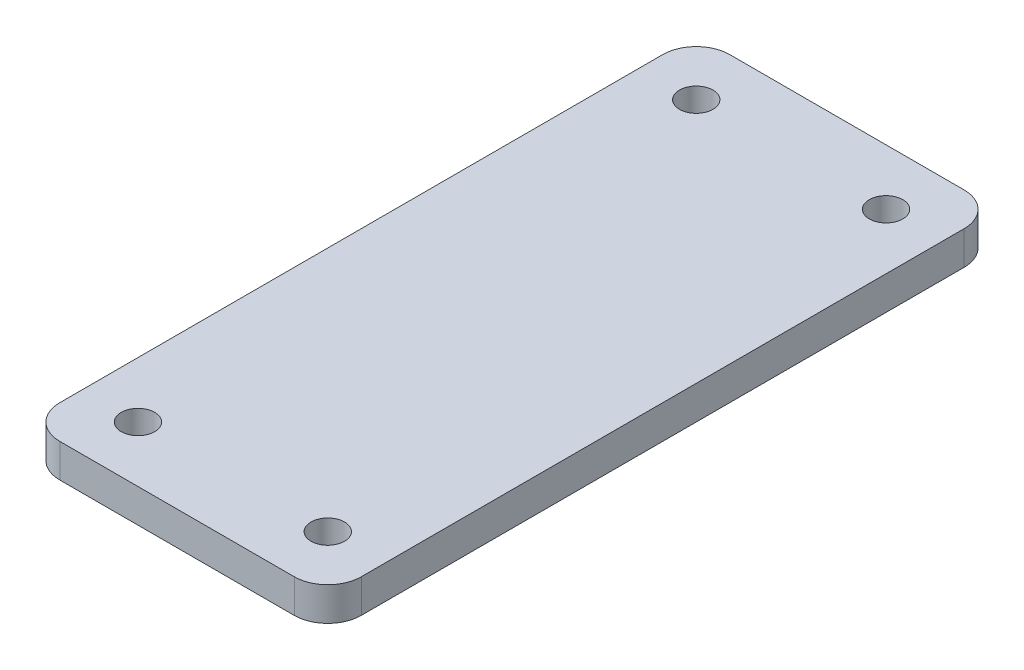
ISO-10303-21;
HEADER;
FILE_DESCRIPTION(('STEP AP214'),'2;1');
FILE_NAME('part.step','',(''),(''),'','','');
FILE_SCHEMA(('AUTOMOTIVE_DESIGN { 1 0 10303 214 1 1 1 1 }'));
ENDSEC;
DATA;
#1=APPLICATION_CONTEXT('core data for automotive mechanical design processes');
#2=APPLICATION_PROTOCOL_DEFINITION('international standard','automotive_design',2000,#1);
#3=PRODUCT_CONTEXT('',#1,'mechanical');
#4=PRODUCT('Part','Part','',(#3));
#5=PRODUCT_RELATED_PRODUCT_CATEGORY('part','',(#4));
#6=PRODUCT_DEFINITION_FORMATION('','',#4);
#7=PRODUCT_DEFINITION_CONTEXT('part definition',#1,'design');
#8=PRODUCT_DEFINITION('design','',#6,#7);
#9=PRODUCT_DEFINITION_SHAPE('','',#8);
#10=(LENGTH_UNIT() NAMED_UNIT(*) SI_UNIT(.MILLI.,.METRE.));
#11=(NAMED_UNIT(*) PLANE_ANGLE_UNIT() SI_UNIT($,.RADIAN.));
#12=(NAMED_UNIT(*) SI_UNIT($,.STERADIAN.) SOLID_ANGLE_UNIT());
#13=UNCERTAINTY_MEASURE_WITH_UNIT(LENGTH_MEASURE(1.E-05),#10,'distance_accuracy_value','');
#14=(GEOMETRIC_REPRESENTATION_CONTEXT(3) GLOBAL_UNCERTAINTY_ASSIGNED_CONTEXT((#13)) GLOBAL_UNIT_ASSIGNED_CONTEXT((#10,
#11,#12)) REPRESENTATION_CONTEXT('',''));
#15=CARTESIAN_POINT('',(0.,0.,0.));
#16=DIRECTION('',(0.,0.,1.));
#17=DIRECTION('',(1.,0.,0.));
#18=AXIS2_PLACEMENT_3D('',#15,#16,#17);
#19=CARTESIAN_POINT('',(-13.5,3.,-30.));
#20=DIRECTION('',(1.,0.,0.));
#21=DIRECTION('',(0.,0.,-1.));
#22=AXIS2_PLACEMENT_3D('',#19,#20,#21);
#23=PLANE('',#22);
#24=DIRECTION('',(0.,0.,1.));
#25=VECTOR('',#24,1.);
#26=CARTESIAN_POINT('',(-13.5,3.,-30.));
#27=LINE('',#26,#25);
#28=CARTESIAN_POINT('',(-13.5,3.,-27.));
#29=VERTEX_POINT('',#28);
#30=CARTESIAN_POINT('',(-13.5,3.,27.));
#31=VERTEX_POINT('',#30);
#32=EDGE_CURVE('E145',#29,#31,#27,.T.);
#33=ORIENTED_EDGE('',*,*,#32,.F.);
#34=DIRECTION('',(0.,-1.,0.));
#35=VECTOR('',#34,1.);
#36=CARTESIAN_POINT('',(-13.5,3.,-27.));
#37=LINE('',#36,#35);
#38=CARTESIAN_POINT('',(-13.5,0.,-27.));
#39=VERTEX_POINT('',#38);
#40=EDGE_CURVE('E152',#29,#39,#37,.T.);
#41=ORIENTED_EDGE('',*,*,#40,.T.);
#42=DIRECTION('',(0.,0.,1.));
#43=VECTOR('',#42,1.);
#44=CARTESIAN_POINT('',(-13.5,0.,-30.));
#45=LINE('',#44,#43);
#46=CARTESIAN_POINT('',(-13.5,0.,27.));
#47=VERTEX_POINT('',#46);
#48=EDGE_CURVE('E133',#39,#47,#45,.T.);
#49=ORIENTED_EDGE('',*,*,#48,.T.);
#50=DIRECTION('',(0.,-1.,0.));
#51=VECTOR('',#50,1.);
#52=CARTESIAN_POINT('',(-13.5,3.,27.));
#53=LINE('',#52,#51);
#54=EDGE_CURVE('E112',#47,#31,#53,.F.);
#55=ORIENTED_EDGE('',*,*,#54,.T.);
#56=EDGE_LOOP('',(#33,#41,#49,#55));
#57=FACE_BOUND('',#56,.T.);
#58=ADVANCED_FACE('F39',(#57),#23,.F.);
#59=CARTESIAN_POINT('',(13.5,3.,30.));
#60=DIRECTION('',(0.,0.,-1.));
#61=DIRECTION('',(-1.,0.,0.));
#62=AXIS2_PLACEMENT_3D('',#59,#60,#61);
#63=PLANE('',#62);
#64=DIRECTION('',(1.,0.,0.));
#65=VECTOR('',#64,1.);
#66=CARTESIAN_POINT('',(13.5,0.,30.));
#67=LINE('',#66,#65);
#68=CARTESIAN_POINT('',(-10.5,0.,30.));
#69=VERTEX_POINT('',#68);
#70=CARTESIAN_POINT('',(10.5,0.,30.));
#71=VERTEX_POINT('',#70);
#72=EDGE_CURVE('E122',#69,#71,#67,.T.);
#73=ORIENTED_EDGE('',*,*,#72,.T.);
#74=DIRECTION('',(0.,-1.,0.));
#75=VECTOR('',#74,1.);
#76=CARTESIAN_POINT('',(10.5,3.,30.));
#77=LINE('',#76,#75);
#78=CARTESIAN_POINT('',(10.5,3.,30.));
#79=VERTEX_POINT('',#78);
#80=EDGE_CURVE('E11',#71,#79,#77,.F.);
#81=ORIENTED_EDGE('',*,*,#80,.T.);
#82=DIRECTION('',(1.,0.,0.));
#83=VECTOR('',#82,1.);
#84=CARTESIAN_POINT('',(13.5,3.,30.));
#85=LINE('',#84,#83);
#86=CARTESIAN_POINT('',(-10.5,3.,30.));
#87=VERTEX_POINT('',#86);
#88=EDGE_CURVE('E124',#87,#79,#85,.T.);
#89=ORIENTED_EDGE('',*,*,#88,.F.);
#90=DIRECTION('',(0.,-1.,0.));
#91=VECTOR('',#90,1.);
#92=CARTESIAN_POINT('',(-10.5,3.,30.));
#93=LINE('',#92,#91);
#94=EDGE_CURVE('E110',#87,#69,#93,.T.);
#95=ORIENTED_EDGE('',*,*,#94,.T.);
#96=EDGE_LOOP('',(#73,#81,#89,#95));
#97=FACE_BOUND('',#96,.T.);
#98=ADVANCED_FACE('F121',(#97),#63,.F.);
#99=CARTESIAN_POINT('',(13.5,3.,-30.));
#100=DIRECTION('',(-1.,0.,0.));
#101=DIRECTION('',(0.,0.,1.));
#102=AXIS2_PLACEMENT_3D('',#99,#100,#101);
#103=PLANE('',#102);
#104=DIRECTION('',(0.,0.,-1.));
#105=VECTOR('',#104,1.);
#106=CARTESIAN_POINT('',(13.5,0.,-30.));
#107=LINE('',#106,#105);
#108=CARTESIAN_POINT('',(13.5,0.,27.));
#109=VERTEX_POINT('',#108);
#110=CARTESIAN_POINT('',(13.5,0.,-27.));
#111=VERTEX_POINT('',#110);
#112=EDGE_CURVE('E132',#109,#111,#107,.T.);
#113=ORIENTED_EDGE('',*,*,#112,.T.);
#114=DIRECTION('',(0.,-1.,0.));
#115=VECTOR('',#114,1.);
#116=CARTESIAN_POINT('',(13.5,3.,-27.));
#117=LINE('',#116,#115);
#118=CARTESIAN_POINT('',(13.5,3.,-27.));
#119=VERTEX_POINT('',#118);
#120=EDGE_CURVE('E48',#111,#119,#117,.F.);
#121=ORIENTED_EDGE('',*,*,#120,.T.);
#122=DIRECTION('',(0.,0.,-1.));
#123=VECTOR('',#122,1.);
#124=CARTESIAN_POINT('',(13.5,3.,-30.));
#125=LINE('',#124,#123);
#126=CARTESIAN_POINT('',(13.5,3.,27.));
#127=VERTEX_POINT('',#126);
#128=EDGE_CURVE('E186',#127,#119,#125,.T.);
#129=ORIENTED_EDGE('',*,*,#128,.F.);
#130=DIRECTION('',(0.,-1.,0.));
#131=VECTOR('',#130,1.);
#132=CARTESIAN_POINT('',(13.5,3.,27.));
#133=LINE('',#132,#131);
#134=EDGE_CURVE('E179',#127,#109,#133,.T.);
#135=ORIENTED_EDGE('',*,*,#134,.T.);
#136=EDGE_LOOP('',(#113,#121,#129,#135));
#137=FACE_BOUND('',#136,.T.);
#138=ADVANCED_FACE('F256',(#137),#103,.F.);
#139=CARTESIAN_POINT('',(13.5,3.,-30.));
#140=DIRECTION('',(0.,0.,1.));
#141=DIRECTION('',(1.,0.,0.));
#142=AXIS2_PLACEMENT_3D('',#139,#140,#141);
#143=PLANE('',#142);
#144=DIRECTION('',(-1.,0.,0.));
#145=VECTOR('',#144,1.);
#146=CARTESIAN_POINT('',(13.5,0.,-30.));
#147=LINE('',#146,#145);
#148=CARTESIAN_POINT('',(10.5,0.,-30.));
#149=VERTEX_POINT('',#148);
#150=CARTESIAN_POINT('',(-10.5,0.,-30.));
#151=VERTEX_POINT('',#150);
#152=EDGE_CURVE('E137',#149,#151,#147,.T.);
#153=ORIENTED_EDGE('',*,*,#152,.T.);
#154=DIRECTION('',(0.,-1.,0.));
#155=VECTOR('',#154,1.);
#156=CARTESIAN_POINT('',(-10.5,3.,-30.));
#157=LINE('',#156,#155);
#158=CARTESIAN_POINT('',(-10.5,3.,-30.));
#159=VERTEX_POINT('',#158);
#160=EDGE_CURVE('E168',#151,#159,#157,.F.);
#161=ORIENTED_EDGE('',*,*,#160,.T.);
#162=DIRECTION('',(-1.,0.,0.));
#163=VECTOR('',#162,1.);
#164=CARTESIAN_POINT('',(13.5,3.,-30.));
#165=LINE('',#164,#163);
#166=CARTESIAN_POINT('',(10.5,3.,-30.));
#167=VERTEX_POINT('',#166);
#168=EDGE_CURVE('E126',#167,#159,#165,.T.);
#169=ORIENTED_EDGE('',*,*,#168,.F.);
#170=DIRECTION('',(0.,-1.,0.));
#171=VECTOR('',#170,1.);
#172=CARTESIAN_POINT('',(10.5,3.,-30.));
#173=LINE('',#172,#171);
#174=EDGE_CURVE('E164',#167,#149,#173,.T.);
#175=ORIENTED_EDGE('',*,*,#174,.T.);
#176=EDGE_LOOP('',(#153,#161,#169,#175));
#177=FACE_BOUND('',#176,.T.);
#178=ADVANCED_FACE('F239',(#177),#143,.F.);
#179=CARTESIAN_POINT('',(0.,3.,0.));
#180=DIRECTION('',(0.,-1.,0.));
#181=DIRECTION('',(0.,0.,-1.));
#182=AXIS2_PLACEMENT_3D('',#179,#180,#181);
#183=PLANE('',#182);
#184=CARTESIAN_POINT('',(-8.50000000000001,3.,-25.));
#185=DIRECTION('',(0.,1.,0.));
#186=DIRECTION('',(0.,0.,1.));
#187=AXIS2_PLACEMENT_3D('',#184,#185,#186);
#188=CIRCLE('',#187,1.5);
#189=CARTESIAN_POINT('',(-8.50000000000001,3.,-23.5));
#190=VERTEX_POINT('',#189);
#191=EDGE_CURVE('E202',#190,#190,#188,.T.);
#192=ORIENTED_EDGE('',*,*,#191,.F.);
#193=EDGE_LOOP('',(#192));
#194=FACE_BOUND('',#193,.T.);
#195=CARTESIAN_POINT('',(-8.5,3.,25.));
#196=DIRECTION('',(0.,1.,0.));
#197=DIRECTION('',(0.,0.,1.));
#198=AXIS2_PLACEMENT_3D('',#195,#196,#197);
#199=CIRCLE('',#198,1.5);
#200=CARTESIAN_POINT('',(-8.5,3.,26.5));
#201=VERTEX_POINT('',#200);
#202=EDGE_CURVE('E210',#201,#201,#199,.T.);
#203=ORIENTED_EDGE('',*,*,#202,.F.);
#204=EDGE_LOOP('',(#203));
#205=FACE_BOUND('',#204,.T.);
#206=CARTESIAN_POINT('',(8.5,3.,25.));
#207=DIRECTION('',(0.,1.,0.));
#208=DIRECTION('',(0.,0.,1.));
#209=AXIS2_PLACEMENT_3D('',#206,#207,#208);
#210=CIRCLE('',#209,1.5);
#211=CARTESIAN_POINT('',(8.5,3.,26.5));
#212=VERTEX_POINT('',#211);
#213=EDGE_CURVE('E218',#212,#212,#210,.T.);
#214=ORIENTED_EDGE('',*,*,#213,.F.);
#215=EDGE_LOOP('',(#214));
#216=FACE_BOUND('',#215,.T.);
#217=CARTESIAN_POINT('',(8.5,3.,-25.));
#218=DIRECTION('',(0.,1.,0.));
#219=DIRECTION('',(0.,0.,1.));
#220=AXIS2_PLACEMENT_3D('',#217,#218,#219);
#221=CIRCLE('',#220,1.5);
#222=CARTESIAN_POINT('',(8.5,3.,-23.5));
#223=VERTEX_POINT('',#222);
#224=EDGE_CURVE('E194',#223,#223,#221,.T.);
#225=ORIENTED_EDGE('',*,*,#224,.F.);
#226=EDGE_LOOP('',(#225));
#227=FACE_BOUND('',#226,.T.);
#228=ORIENTED_EDGE('',*,*,#168,.T.);
#229=CARTESIAN_POINT('',(-10.5,3.,-27.));
#230=DIRECTION('',(0.,-1.,0.));
#231=DIRECTION('',(0.,0.,-1.));
#232=AXIS2_PLACEMENT_3D('',#229,#230,#231);
#233=CIRCLE('',#232,3.);
#234=EDGE_CURVE('E176',#159,#29,#233,.F.);
#235=ORIENTED_EDGE('',*,*,#234,.T.);
#236=ORIENTED_EDGE('',*,*,#32,.T.);
#237=CARTESIAN_POINT('',(-10.5,3.,27.));
#238=DIRECTION('',(0.,-1.,0.));
#239=DIRECTION('',(0.,0.,-1.));
#240=AXIS2_PLACEMENT_3D('',#237,#238,#239);
#241=CIRCLE('',#240,3.);
#242=EDGE_CURVE('E149',#31,#87,#241,.F.);
#243=ORIENTED_EDGE('',*,*,#242,.T.);
#244=ORIENTED_EDGE('',*,*,#88,.T.);
#245=CARTESIAN_POINT('',(10.5,3.,27.));
#246=DIRECTION('',(0.,-1.,0.));
#247=DIRECTION('',(0.,0.,-1.));
#248=AXIS2_PLACEMENT_3D('',#245,#246,#247);
#249=CIRCLE('',#248,3.);
#250=EDGE_CURVE('E61',#79,#127,#249,.F.);
#251=ORIENTED_EDGE('',*,*,#250,.T.);
#252=ORIENTED_EDGE('',*,*,#128,.T.);
#253=CARTESIAN_POINT('',(10.5,3.,-27.));
#254=DIRECTION('',(0.,-1.,0.));
#255=DIRECTION('',(0.,0.,-1.));
#256=AXIS2_PLACEMENT_3D('',#253,#254,#255);
#257=CIRCLE('',#256,3.);
#258=EDGE_CURVE('E173',#119,#167,#257,.F.);
#259=ORIENTED_EDGE('',*,*,#258,.T.);
#260=EDGE_LOOP('',(#228,#235,#236,#243,#244,#251,#252,#259));
#261=FACE_BOUND('',#260,.T.);
#262=ADVANCED_FACE('F236',(#194,#205,#216,#227,#261),#183,.F.);
#263=CARTESIAN_POINT('',(0.,0.,0.));
#264=DIRECTION('',(0.,-1.,0.));
#265=DIRECTION('',(0.,0.,-1.));
#266=AXIS2_PLACEMENT_3D('',#263,#264,#265);
#267=PLANE('',#266);
#268=CARTESIAN_POINT('',(-8.50000000000001,0.,-25.));
#269=DIRECTION('',(0.,1.,0.));
#270=DIRECTION('',(0.,0.,1.));
#271=AXIS2_PLACEMENT_3D('',#268,#269,#270);
#272=CIRCLE('',#271,1.5);
#273=CARTESIAN_POINT('',(-8.50000000000001,0.,-23.5));
#274=VERTEX_POINT('',#273);
#275=EDGE_CURVE('E206',#274,#274,#272,.T.);
#276=ORIENTED_EDGE('',*,*,#275,.T.);
#277=EDGE_LOOP('',(#276));
#278=FACE_BOUND('',#277,.T.);
#279=CARTESIAN_POINT('',(-8.5,0.,25.));
#280=DIRECTION('',(0.,1.,0.));
#281=DIRECTION('',(0.,0.,1.));
#282=AXIS2_PLACEMENT_3D('',#279,#280,#281);
#283=CIRCLE('',#282,1.5);
#284=CARTESIAN_POINT('',(-8.5,0.,26.5));
#285=VERTEX_POINT('',#284);
#286=EDGE_CURVE('E214',#285,#285,#283,.T.);
#287=ORIENTED_EDGE('',*,*,#286,.T.);
#288=EDGE_LOOP('',(#287));
#289=FACE_BOUND('',#288,.T.);
#290=CARTESIAN_POINT('',(8.5,0.,25.));
#291=DIRECTION('',(0.,1.,0.));
#292=DIRECTION('',(0.,0.,1.));
#293=AXIS2_PLACEMENT_3D('',#290,#291,#292);
#294=CIRCLE('',#293,1.5);
#295=CARTESIAN_POINT('',(8.5,0.,26.5));
#296=VERTEX_POINT('',#295);
#297=EDGE_CURVE('E198',#296,#296,#294,.T.);
#298=ORIENTED_EDGE('',*,*,#297,.T.);
#299=EDGE_LOOP('',(#298));
#300=FACE_BOUND('',#299,.T.);
#301=CARTESIAN_POINT('',(8.5,0.,-25.));
#302=DIRECTION('',(0.,1.,0.));
#303=DIRECTION('',(0.,0.,1.));
#304=AXIS2_PLACEMENT_3D('',#301,#302,#303);
#305=CIRCLE('',#304,1.5);
#306=CARTESIAN_POINT('',(8.5,0.,-23.5));
#307=VERTEX_POINT('',#306);
#308=EDGE_CURVE('E139',#307,#307,#305,.T.);
#309=ORIENTED_EDGE('',*,*,#308,.T.);
#310=EDGE_LOOP('',(#309));
#311=FACE_BOUND('',#310,.T.);
#312=ORIENTED_EDGE('',*,*,#48,.F.);
#313=CARTESIAN_POINT('',(-10.5,0.,-27.));
#314=DIRECTION('',(0.,-1.,0.));
#315=DIRECTION('',(0.,0.,-1.));
#316=AXIS2_PLACEMENT_3D('',#313,#314,#315);
#317=CIRCLE('',#316,3.);
#318=EDGE_CURVE('E161',#39,#151,#317,.T.);
#319=ORIENTED_EDGE('',*,*,#318,.T.);
#320=ORIENTED_EDGE('',*,*,#152,.F.);
#321=CARTESIAN_POINT('',(10.5,0.,-27.));
#322=DIRECTION('',(0.,-1.,0.));
#323=DIRECTION('',(0.,0.,-1.));
#324=AXIS2_PLACEMENT_3D('',#321,#322,#323);
#325=CIRCLE('',#324,3.);
#326=EDGE_CURVE('E158',#149,#111,#325,.T.);
#327=ORIENTED_EDGE('',*,*,#326,.T.);
#328=ORIENTED_EDGE('',*,*,#112,.F.);
#329=CARTESIAN_POINT('',(10.5,0.,27.));
#330=DIRECTION('',(0.,-1.,0.));
#331=DIRECTION('',(0.,0.,-1.));
#332=AXIS2_PLACEMENT_3D('',#329,#330,#331);
#333=CIRCLE('',#332,3.);
#334=EDGE_CURVE('E130',#109,#71,#333,.T.);
#335=ORIENTED_EDGE('',*,*,#334,.T.);
#336=ORIENTED_EDGE('',*,*,#72,.F.);
#337=CARTESIAN_POINT('',(-10.5,0.,27.));
#338=DIRECTION('',(0.,-1.,0.));
#339=DIRECTION('',(0.,0.,-1.));
#340=AXIS2_PLACEMENT_3D('',#337,#338,#339);
#341=CIRCLE('',#340,3.);
#342=EDGE_CURVE('E106',#69,#47,#341,.T.);
#343=ORIENTED_EDGE('',*,*,#342,.T.);
#344=EDGE_LOOP('',(#312,#319,#320,#327,#328,#335,#336,#343));
#345=FACE_BOUND('',#344,.T.);
#346=ADVANCED_FACE('F128',(#278,#289,#300,#311,#345),#267,.T.);
#347=CARTESIAN_POINT('',(8.5,0.,-25.));
#348=DIRECTION('',(0.,1.,0.));
#349=DIRECTION('',(0.,0.,1.));
#350=AXIS2_PLACEMENT_3D('',#347,#348,#349);
#351=CYLINDRICAL_SURFACE('',#350,1.5);
#352=ORIENTED_EDGE('',*,*,#308,.F.);
#353=EDGE_LOOP('',(#352));
#354=FACE_BOUND('',#353,.T.);
#355=ORIENTED_EDGE('',*,*,#224,.T.);
#356=EDGE_LOOP('',(#355));
#357=FACE_BOUND('',#356,.T.);
#358=ADVANCED_FACE('F232',(#354,#357),#351,.F.);
#359=CARTESIAN_POINT('',(8.5,0.,25.));
#360=DIRECTION('',(0.,1.,0.));
#361=DIRECTION('',(0.,0.,1.));
#362=AXIS2_PLACEMENT_3D('',#359,#360,#361);
#363=CYLINDRICAL_SURFACE('',#362,1.5);
#364=ORIENTED_EDGE('',*,*,#297,.F.);
#365=EDGE_LOOP('',(#364));
#366=FACE_BOUND('',#365,.T.);
#367=ORIENTED_EDGE('',*,*,#213,.T.);
#368=EDGE_LOOP('',(#367));
#369=FACE_BOUND('',#368,.T.);
#370=ADVANCED_FACE('F228',(#366,#369),#363,.F.);
#371=CARTESIAN_POINT('',(-8.5,0.,25.));
#372=DIRECTION('',(0.,1.,0.));
#373=DIRECTION('',(0.,0.,1.));
#374=AXIS2_PLACEMENT_3D('',#371,#372,#373);
#375=CYLINDRICAL_SURFACE('',#374,1.5);
#376=ORIENTED_EDGE('',*,*,#286,.F.);
#377=EDGE_LOOP('',(#376));
#378=FACE_BOUND('',#377,.T.);
#379=ORIENTED_EDGE('',*,*,#202,.T.);
#380=EDGE_LOOP('',(#379));
#381=FACE_BOUND('',#380,.T.);
#382=ADVANCED_FACE('F231',(#378,#381),#375,.F.);
#383=CARTESIAN_POINT('',(-8.50000000000001,0.,-25.));
#384=DIRECTION('',(0.,1.,0.));
#385=DIRECTION('',(0.,0.,1.));
#386=AXIS2_PLACEMENT_3D('',#383,#384,#385);
#387=CYLINDRICAL_SURFACE('',#386,1.5);
#388=ORIENTED_EDGE('',*,*,#275,.F.);
#389=EDGE_LOOP('',(#388));
#390=FACE_BOUND('',#389,.T.);
#391=ORIENTED_EDGE('',*,*,#191,.T.);
#392=EDGE_LOOP('',(#391));
#393=FACE_BOUND('',#392,.T.);
#394=ADVANCED_FACE('F273',(#390,#393),#387,.F.);
#395=CARTESIAN_POINT('',(-10.5,3.,27.));
#396=DIRECTION('',(0.,-1.,0.));
#397=DIRECTION('',(0.,0.,-1.));
#398=AXIS2_PLACEMENT_3D('',#395,#396,#397);
#399=CYLINDRICAL_SURFACE('',#398,3.);
#400=ORIENTED_EDGE('',*,*,#242,.F.);
#401=ORIENTED_EDGE('',*,*,#54,.F.);
#402=ORIENTED_EDGE('',*,*,#342,.F.);
#403=ORIENTED_EDGE('',*,*,#94,.F.);
#404=EDGE_LOOP('',(#400,#401,#402,#403));
#405=FACE_BOUND('',#404,.T.);
#406=ADVANCED_FACE('F109',(#405),#399,.T.);
#407=CARTESIAN_POINT('',(-10.5,3.,-27.));
#408=DIRECTION('',(0.,-1.,0.));
#409=DIRECTION('',(0.,0.,-1.));
#410=AXIS2_PLACEMENT_3D('',#407,#408,#409);
#411=CYLINDRICAL_SURFACE('',#410,3.);
#412=ORIENTED_EDGE('',*,*,#234,.F.);
#413=ORIENTED_EDGE('',*,*,#160,.F.);
#414=ORIENTED_EDGE('',*,*,#318,.F.);
#415=ORIENTED_EDGE('',*,*,#40,.F.);
#416=EDGE_LOOP('',(#412,#413,#414,#415));
#417=FACE_BOUND('',#416,.T.);
#418=ADVANCED_FACE('F251',(#417),#411,.T.);
#419=CARTESIAN_POINT('',(10.5,3.,-27.));
#420=DIRECTION('',(0.,-1.,0.));
#421=DIRECTION('',(0.,0.,-1.));
#422=AXIS2_PLACEMENT_3D('',#419,#420,#421);
#423=CYLINDRICAL_SURFACE('',#422,3.);
#424=ORIENTED_EDGE('',*,*,#258,.F.);
#425=ORIENTED_EDGE('',*,*,#120,.F.);
#426=ORIENTED_EDGE('',*,*,#326,.F.);
#427=ORIENTED_EDGE('',*,*,#174,.F.);
#428=EDGE_LOOP('',(#424,#425,#426,#427));
#429=FACE_BOUND('',#428,.T.);
#430=ADVANCED_FACE('F255',(#429),#423,.T.);
#431=CARTESIAN_POINT('',(10.5,3.,27.));
#432=DIRECTION('',(0.,-1.,0.));
#433=DIRECTION('',(0.,0.,-1.));
#434=AXIS2_PLACEMENT_3D('',#431,#432,#433);
#435=CYLINDRICAL_SURFACE('',#434,3.);
#436=ORIENTED_EDGE('',*,*,#250,.F.);
#437=ORIENTED_EDGE('',*,*,#80,.F.);
#438=ORIENTED_EDGE('',*,*,#334,.F.);
#439=ORIENTED_EDGE('',*,*,#134,.F.);
#440=EDGE_LOOP('',(#436,#437,#438,#439));
#441=FACE_BOUND('',#440,.T.);
#442=ADVANCED_FACE('F41',(#441),#435,.T.);
#443=CLOSED_SHELL('',(#58,#98,#138,#178,#262,#346,#358,#370,#382,#394,#406,#418,#430,#442));
#444=MANIFOLD_SOLID_BREP('B2',#443);
#445=ADVANCED_BREP_SHAPE_REPRESENTATION('',(#18,#444),#14);
#446=SHAPE_DEFINITION_REPRESENTATION(#9,#445);
ENDSEC;
END-ISO-10303-21;
